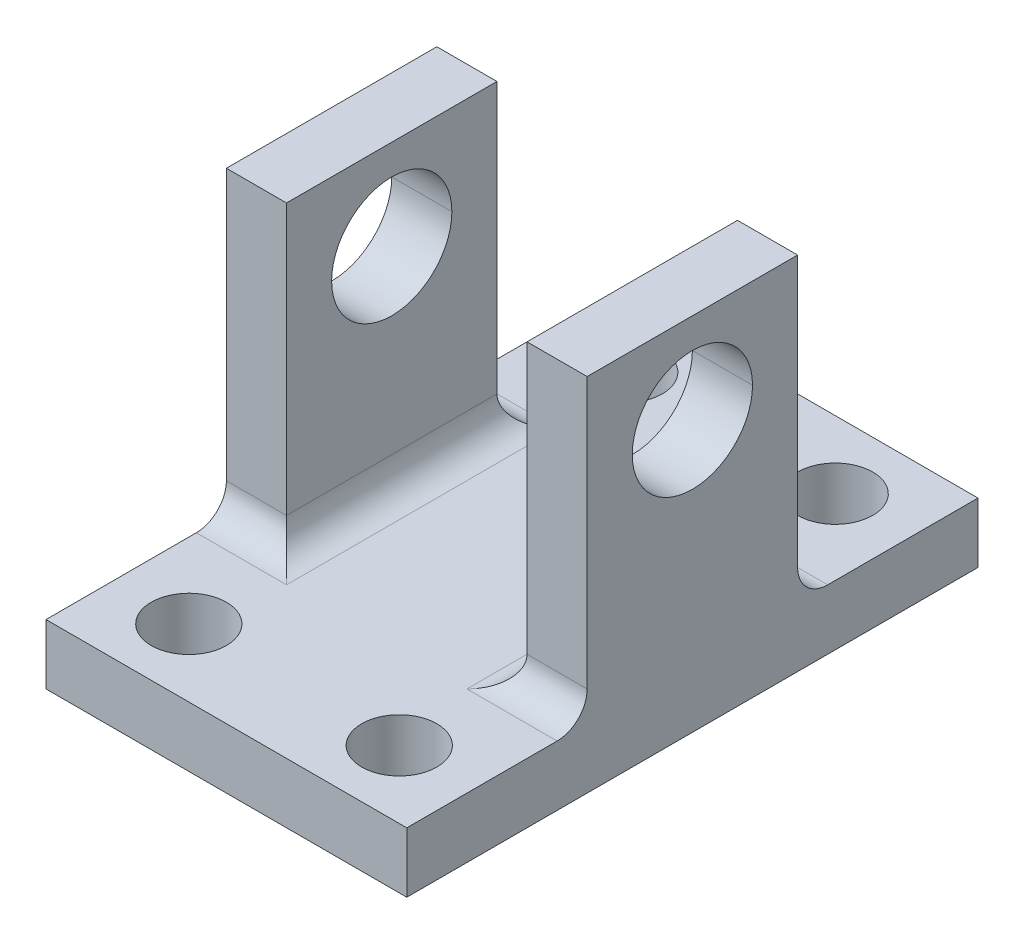
ISO-10303-21;
HEADER;
FILE_DESCRIPTION(('STEP AP214'),'2;1');
FILE_NAME('part.step','',(''),(''),'','','');
FILE_SCHEMA(('AUTOMOTIVE_DESIGN { 1 0 10303 214 1 1 1 1 }'));
ENDSEC;
DATA;
#1=APPLICATION_CONTEXT('core data for automotive mechanical design processes');
#2=APPLICATION_PROTOCOL_DEFINITION('international standard','automotive_design',2000,#1);
#3=PRODUCT_CONTEXT('',#1,'mechanical');
#4=PRODUCT('Part','Part','',(#3));
#5=PRODUCT_RELATED_PRODUCT_CATEGORY('part','',(#4));
#6=PRODUCT_DEFINITION_FORMATION('','',#4);
#7=PRODUCT_DEFINITION_CONTEXT('part definition',#1,'design');
#8=PRODUCT_DEFINITION('design','',#6,#7);
#9=PRODUCT_DEFINITION_SHAPE('','',#8);
#10=(LENGTH_UNIT() NAMED_UNIT(*) SI_UNIT(.MILLI.,.METRE.));
#11=(NAMED_UNIT(*) PLANE_ANGLE_UNIT() SI_UNIT($,.RADIAN.));
#12=(NAMED_UNIT(*) SI_UNIT($,.STERADIAN.) SOLID_ANGLE_UNIT());
#13=UNCERTAINTY_MEASURE_WITH_UNIT(LENGTH_MEASURE(1.E-05),#10,'distance_accuracy_value','');
#14=(GEOMETRIC_REPRESENTATION_CONTEXT(3) GLOBAL_UNCERTAINTY_ASSIGNED_CONTEXT((#13)) GLOBAL_UNIT_ASSIGNED_CONTEXT((#10,
#11,#12)) REPRESENTATION_CONTEXT('',''));
#15=CARTESIAN_POINT('',(0.,0.,0.));
#16=DIRECTION('',(0.,0.,1.));
#17=DIRECTION('',(1.,0.,0.));
#18=AXIS2_PLACEMENT_3D('',#15,#16,#17);
#19=CARTESIAN_POINT('',(0.,18.,0.));
#20=DIRECTION('',(-1.,0.,0.));
#21=DIRECTION('',(0.,-1.,0.));
#22=AXIS2_PLACEMENT_3D('',#19,#20,#21);
#23=CYLINDRICAL_SURFACE('',#22,4.);
#24=CARTESIAN_POINT('',(0.,18.,0.));
#25=DIRECTION('',(-1.,0.,0.));
#26=DIRECTION('',(0.,-1.,0.));
#27=AXIS2_PLACEMENT_3D('',#24,#25,#26);
#28=CIRCLE('',#27,4.);
#29=CARTESIAN_POINT('',(0.,18.,-4.));
#30=VERTEX_POINT('',#29);
#31=CARTESIAN_POINT('',(0.,18.,4.));
#32=VERTEX_POINT('',#31);
#33=EDGE_CURVE('E330',#30,#32,#28,.T.);
#34=ORIENTED_EDGE('',*,*,#33,.F.);
#35=DIRECTION('',(-1.,0.,0.));
#36=VECTOR('',#35,1.);
#37=CARTESIAN_POINT('',(0.,18.,-4.));
#38=LINE('',#37,#36);
#39=CARTESIAN_POINT('',(-4.,18.,-4.));
#40=VERTEX_POINT('',#39);
#41=EDGE_CURVE('E11',#30,#40,#38,.T.);
#42=ORIENTED_EDGE('',*,*,#41,.T.);
#43=CARTESIAN_POINT('',(-4.,18.,0.));
#44=DIRECTION('',(1.,0.,0.));
#45=DIRECTION('',(0.,1.,0.));
#46=AXIS2_PLACEMENT_3D('',#43,#44,#45);
#47=CIRCLE('',#46,4.);
#48=CARTESIAN_POINT('',(-4.,18.,4.));
#49=VERTEX_POINT('',#48);
#50=EDGE_CURVE('E333',#49,#40,#47,.T.);
#51=ORIENTED_EDGE('',*,*,#50,.F.);
#52=DIRECTION('',(1.,0.,0.));
#53=VECTOR('',#52,1.);
#54=CARTESIAN_POINT('',(0.,18.,4.));
#55=LINE('',#54,#53);
#56=EDGE_CURVE('E53',#49,#32,#55,.T.);
#57=ORIENTED_EDGE('',*,*,#56,.T.);
#58=EDGE_LOOP('',(#34,#42,#51,#57));
#59=FACE_BOUND('',#58,.T.);
#60=ADVANCED_FACE('F44',(#59),#23,.F.);
#61=CARTESIAN_POINT('',(-20.,18.,0.));
#62=DIRECTION('',(1.,0.,0.));
#63=DIRECTION('',(0.,1.,0.));
#64=AXIS2_PLACEMENT_3D('',#61,#62,#63);
#65=CIRCLE('',#64,4.);
#66=CARTESIAN_POINT('',(-20.,18.,4.));
#67=VERTEX_POINT('',#66);
#68=CARTESIAN_POINT('',(-20.,18.,-4.));
#69=VERTEX_POINT('',#68);
#70=EDGE_CURVE('E241',#67,#69,#65,.T.);
#71=ORIENTED_EDGE('',*,*,#70,.T.);
#72=DIRECTION('',(-1.,0.,0.));
#73=VECTOR('',#72,1.);
#74=CARTESIAN_POINT('',(0.,18.,-4.));
#75=LINE('',#74,#73);
#76=CARTESIAN_POINT('',(-24.,18.,-4.));
#77=VERTEX_POINT('',#76);
#78=EDGE_CURVE('E323',#69,#77,#75,.T.);
#79=ORIENTED_EDGE('',*,*,#78,.T.);
#80=CARTESIAN_POINT('',(-24.,18.,0.));
#81=DIRECTION('',(-1.,0.,0.));
#82=DIRECTION('',(0.,-1.,0.));
#83=AXIS2_PLACEMENT_3D('',#80,#81,#82);
#84=CIRCLE('',#83,4.);
#85=CARTESIAN_POINT('',(-24.,18.,4.));
#86=VERTEX_POINT('',#85);
#87=EDGE_CURVE('E415',#77,#86,#84,.T.);
#88=ORIENTED_EDGE('',*,*,#87,.T.);
#89=DIRECTION('',(1.,0.,0.));
#90=VECTOR('',#89,1.);
#91=CARTESIAN_POINT('',(0.,18.,4.));
#92=LINE('',#91,#90);
#93=EDGE_CURVE('E303',#86,#67,#92,.T.);
#94=ORIENTED_EDGE('',*,*,#93,.T.);
#95=EDGE_LOOP('',(#71,#79,#88,#94));
#96=FACE_BOUND('',#95,.T.);
#97=ADVANCED_FACE('F373',(#96),#23,.F.);
#98=CARTESIAN_POINT('',(-4.,24.,19.));
#99=DIRECTION('',(1.,0.,0.));
#100=DIRECTION('',(0.,1.,0.));
#101=AXIS2_PLACEMENT_3D('',#98,#99,#100);
#102=PLANE('',#101);
#103=ORIENTED_EDGE('',*,*,#50,.T.);
#104=EDGE_CURVE('E245',#40,#49,#47,.T.);
#105=ORIENTED_EDGE('',*,*,#104,.T.);
#106=EDGE_LOOP('',(#103,#105));
#107=FACE_BOUND('',#106,.T.);
#108=DIRECTION('',(0.,-1.,0.));
#109=VECTOR('',#108,1.);
#110=CARTESIAN_POINT('',(-4.,24.,-7.));
#111=LINE('',#110,#109);
#112=CARTESIAN_POINT('',(-4.,24.,-7.));
#113=VERTEX_POINT('',#112);
#114=CARTESIAN_POINT('',(-4.,6.,-7.));
#115=VERTEX_POINT('',#114);
#116=EDGE_CURVE('E376',#113,#115,#111,.T.);
#117=ORIENTED_EDGE('',*,*,#116,.T.);
#118=DIRECTION('',(0.,0.,-1.));
#119=VECTOR('',#118,1.);
#120=CARTESIAN_POINT('',(-4.,6.,7.));
#121=LINE('',#120,#119);
#122=CARTESIAN_POINT('',(-4.,6.,7.));
#123=VERTEX_POINT('',#122);
#124=EDGE_CURVE('E279',#115,#123,#121,.F.);
#125=ORIENTED_EDGE('',*,*,#124,.T.);
#126=DIRECTION('',(0.,1.,0.));
#127=VECTOR('',#126,1.);
#128=CARTESIAN_POINT('',(-4.,24.,7.));
#129=LINE('',#128,#127);
#130=CARTESIAN_POINT('',(-4.,24.,7.));
#131=VERTEX_POINT('',#130);
#132=EDGE_CURVE('E394',#123,#131,#129,.T.);
#133=ORIENTED_EDGE('',*,*,#132,.T.);
#134=DIRECTION('',(0.,0.,-1.));
#135=VECTOR('',#134,1.);
#136=CARTESIAN_POINT('',(-4.,24.,19.));
#137=LINE('',#136,#135);
#138=EDGE_CURVE('E228',#131,#113,#137,.T.);
#139=ORIENTED_EDGE('',*,*,#138,.T.);
#140=EDGE_LOOP('',(#117,#125,#133,#139));
#141=FACE_BOUND('',#140,.T.);
#142=ADVANCED_FACE('F369',(#107,#141),#102,.F.);
#143=CARTESIAN_POINT('',(-20.,24.,19.));
#144=DIRECTION('',(1.,0.,0.));
#145=DIRECTION('',(0.,1.,0.));
#146=AXIS2_PLACEMENT_3D('',#143,#144,#145);
#147=PLANE('',#146);
#148=DIRECTION('',(0.,1.,0.));
#149=VECTOR('',#148,1.);
#150=CARTESIAN_POINT('',(-20.,24.,7.));
#151=LINE('',#150,#149);
#152=CARTESIAN_POINT('',(-20.,6.,7.));
#153=VERTEX_POINT('',#152);
#154=CARTESIAN_POINT('',(-20.,24.,7.));
#155=VERTEX_POINT('',#154);
#156=EDGE_CURVE('E514',#153,#155,#151,.T.);
#157=ORIENTED_EDGE('',*,*,#156,.F.);
#158=DIRECTION('',(0.,0.,-1.));
#159=VECTOR('',#158,1.);
#160=CARTESIAN_POINT('',(-20.,6.,19.));
#161=LINE('',#160,#159);
#162=CARTESIAN_POINT('',(-20.,6.,-7.));
#163=VERTEX_POINT('',#162);
#164=EDGE_CURVE('E285',#153,#163,#161,.T.);
#165=ORIENTED_EDGE('',*,*,#164,.T.);
#166=DIRECTION('',(0.,-1.,0.));
#167=VECTOR('',#166,1.);
#168=CARTESIAN_POINT('',(-20.,24.,-7.));
#169=LINE('',#168,#167);
#170=CARTESIAN_POINT('',(-20.,24.,-7.));
#171=VERTEX_POINT('',#170);
#172=EDGE_CURVE('E385',#171,#163,#169,.T.);
#173=ORIENTED_EDGE('',*,*,#172,.F.);
#174=DIRECTION('',(0.,0.,-1.));
#175=VECTOR('',#174,1.);
#176=CARTESIAN_POINT('',(-20.,24.,19.));
#177=LINE('',#176,#175);
#178=EDGE_CURVE('E232',#155,#171,#177,.T.);
#179=ORIENTED_EDGE('',*,*,#178,.F.);
#180=EDGE_LOOP('',(#157,#165,#173,#179));
#181=FACE_BOUND('',#180,.T.);
#182=ORIENTED_EDGE('',*,*,#70,.F.);
#183=EDGE_CURVE('E246',#69,#67,#65,.T.);
#184=ORIENTED_EDGE('',*,*,#183,.F.);
#185=EDGE_LOOP('',(#182,#184));
#186=FACE_BOUND('',#185,.T.);
#187=ADVANCED_FACE('F372',(#181,#186),#147,.T.);
#188=CARTESIAN_POINT('',(-24.,0.,19.));
#189=DIRECTION('',(-1.,0.,0.));
#190=DIRECTION('',(0.,0.,1.));
#191=AXIS2_PLACEMENT_3D('',#188,#189,#190);
#192=PLANE('',#191);
#193=DIRECTION('',(0.,1.,0.));
#194=VECTOR('',#193,1.);
#195=CARTESIAN_POINT('',(-24.,24.,-7.));
#196=LINE('',#195,#194);
#197=CARTESIAN_POINT('',(-24.,6.,-7.));
#198=VERTEX_POINT('',#197);
#199=CARTESIAN_POINT('',(-24.,24.,-7.));
#200=VERTEX_POINT('',#199);
#201=EDGE_CURVE('E202',#198,#200,#196,.T.);
#202=ORIENTED_EDGE('',*,*,#201,.F.);
#203=CARTESIAN_POINT('',(-24.,6.,-9.));
#204=DIRECTION('',(-1.,0.,0.));
#205=DIRECTION('',(0.,0.,1.));
#206=AXIS2_PLACEMENT_3D('',#203,#204,#205);
#207=CIRCLE('',#206,2.);
#208=CARTESIAN_POINT('',(-24.,4.,-9.));
#209=VERTEX_POINT('',#208);
#210=EDGE_CURVE('E291',#198,#209,#207,.F.);
#211=ORIENTED_EDGE('',*,*,#210,.T.);
#212=DIRECTION('',(0.,0.,1.));
#213=VECTOR('',#212,1.);
#214=CARTESIAN_POINT('',(-24.,3.99999999999999,-19.));
#215=LINE('',#214,#213);
#216=CARTESIAN_POINT('',(-24.,3.99999999999999,-19.));
#217=VERTEX_POINT('',#216);
#218=EDGE_CURVE('E512',#217,#209,#215,.T.);
#219=ORIENTED_EDGE('',*,*,#218,.F.);
#220=DIRECTION('',(0.,1.,0.));
#221=VECTOR('',#220,1.);
#222=CARTESIAN_POINT('',(-24.,0.,-19.));
#223=LINE('',#222,#221);
#224=CARTESIAN_POINT('',(-24.,0.,-19.));
#225=VERTEX_POINT('',#224);
#226=EDGE_CURVE('E186',#225,#217,#223,.T.);
#227=ORIENTED_EDGE('',*,*,#226,.F.);
#228=DIRECTION('',(0.,0.,-1.));
#229=VECTOR('',#228,1.);
#230=CARTESIAN_POINT('',(-24.,0.,19.));
#231=LINE('',#230,#229);
#232=CARTESIAN_POINT('',(-24.,0.,19.));
#233=VERTEX_POINT('',#232);
#234=EDGE_CURVE('E218',#233,#225,#231,.T.);
#235=ORIENTED_EDGE('',*,*,#234,.F.);
#236=DIRECTION('',(0.,1.,0.));
#237=VECTOR('',#236,1.);
#238=CARTESIAN_POINT('',(-24.,0.,19.));
#239=LINE('',#238,#237);
#240=CARTESIAN_POINT('',(-24.,3.99999999999999,19.));
#241=VERTEX_POINT('',#240);
#242=EDGE_CURVE('E214',#233,#241,#239,.T.);
#243=ORIENTED_EDGE('',*,*,#242,.T.);
#244=DIRECTION('',(0.,0.,1.));
#245=VECTOR('',#244,1.);
#246=CARTESIAN_POINT('',(-24.,3.99999999999999,19.));
#247=LINE('',#246,#245);
#248=CARTESIAN_POINT('',(-24.,4.,9.));
#249=VERTEX_POINT('',#248);
#250=EDGE_CURVE('E498',#249,#241,#247,.T.);
#251=ORIENTED_EDGE('',*,*,#250,.F.);
#252=CARTESIAN_POINT('',(-24.,6.,9.));
#253=DIRECTION('',(-1.,0.,0.));
#254=DIRECTION('',(0.,0.,1.));
#255=AXIS2_PLACEMENT_3D('',#252,#253,#254);
#256=CIRCLE('',#255,2.);
#257=CARTESIAN_POINT('',(-24.,6.,7.));
#258=VERTEX_POINT('',#257);
#259=EDGE_CURVE('E300',#249,#258,#256,.F.);
#260=ORIENTED_EDGE('',*,*,#259,.T.);
#261=DIRECTION('',(0.,-1.,0.));
#262=VECTOR('',#261,1.);
#263=CARTESIAN_POINT('',(-24.,24.,7.));
#264=LINE('',#263,#262);
#265=CARTESIAN_POINT('',(-24.,24.,7.));
#266=VERTEX_POINT('',#265);
#267=EDGE_CURVE('E313',#266,#258,#264,.T.);
#268=ORIENTED_EDGE('',*,*,#267,.F.);
#269=DIRECTION('',(0.,0.,-1.));
#270=VECTOR('',#269,1.);
#271=CARTESIAN_POINT('',(-24.,24.,19.));
#272=LINE('',#271,#270);
#273=EDGE_CURVE('E236',#266,#200,#272,.T.);
#274=ORIENTED_EDGE('',*,*,#273,.T.);
#275=EDGE_LOOP('',(#202,#211,#219,#227,#235,#243,#251,#260,#268,#274));
#276=FACE_BOUND('',#275,.T.);
#277=EDGE_CURVE('E342',#86,#77,#84,.T.);
#278=ORIENTED_EDGE('',*,*,#277,.F.);
#279=ORIENTED_EDGE('',*,*,#87,.F.);
#280=EDGE_LOOP('',(#278,#279));
#281=FACE_BOUND('',#280,.T.);
#282=ADVANCED_FACE('F432',(#276,#281),#192,.T.);
#283=CARTESIAN_POINT('',(-24.,0.,19.));
#284=DIRECTION('',(0.,1.,0.));
#285=DIRECTION('',(0.,0.,1.));
#286=AXIS2_PLACEMENT_3D('',#283,#284,#285);
#287=PLANE('',#286);
#288=CARTESIAN_POINT('',(-19.,0.,14.5));
#289=DIRECTION('',(0.,1.,0.));
#290=DIRECTION('',(1.,0.,0.));
#291=AXIS2_PLACEMENT_3D('',#288,#289,#290);
#292=CIRCLE('',#291,2.5);
#293=CARTESIAN_POINT('',(-16.5,0.,14.5));
#294=VERTEX_POINT('',#293);
#295=EDGE_CURVE('E384',#294,#294,#292,.T.);
#296=ORIENTED_EDGE('',*,*,#295,.T.);
#297=EDGE_LOOP('',(#296));
#298=FACE_BOUND('',#297,.T.);
#299=CARTESIAN_POINT('',(-4.99999999999999,0.,14.5));
#300=DIRECTION('',(0.,1.,0.));
#301=DIRECTION('',(-1.,0.,0.));
#302=AXIS2_PLACEMENT_3D('',#299,#300,#301);
#303=CIRCLE('',#302,2.5);
#304=CARTESIAN_POINT('',(-7.49999999999999,0.,14.5));
#305=VERTEX_POINT('',#304);
#306=EDGE_CURVE('E391',#305,#305,#303,.T.);
#307=ORIENTED_EDGE('',*,*,#306,.T.);
#308=EDGE_LOOP('',(#307));
#309=FACE_BOUND('',#308,.T.);
#310=CARTESIAN_POINT('',(-4.99999999999999,0.,-14.5));
#311=DIRECTION('',(0.,1.,0.));
#312=DIRECTION('',(1.,0.,0.));
#313=AXIS2_PLACEMENT_3D('',#310,#311,#312);
#314=CIRCLE('',#313,2.5);
#315=CARTESIAN_POINT('',(-2.49999999999999,0.,-14.5));
#316=VERTEX_POINT('',#315);
#317=EDGE_CURVE('E398',#316,#316,#314,.T.);
#318=ORIENTED_EDGE('',*,*,#317,.T.);
#319=EDGE_LOOP('',(#318));
#320=FACE_BOUND('',#319,.T.);
#321=CARTESIAN_POINT('',(-19.,0.,-14.5));
#322=DIRECTION('',(0.,1.,0.));
#323=DIRECTION('',(-1.,0.,0.));
#324=AXIS2_PLACEMENT_3D('',#321,#322,#323);
#325=CIRCLE('',#324,2.5);
#326=CARTESIAN_POINT('',(-21.5,0.,-14.5));
#327=VERTEX_POINT('',#326);
#328=EDGE_CURVE('E402',#327,#327,#325,.T.);
#329=ORIENTED_EDGE('',*,*,#328,.T.);
#330=EDGE_LOOP('',(#329));
#331=FACE_BOUND('',#330,.T.);
#332=DIRECTION('',(1.,0.,0.));
#333=VECTOR('',#332,1.);
#334=CARTESIAN_POINT('',(-24.,0.,-19.));
#335=LINE('',#334,#333);
#336=CARTESIAN_POINT('',(0.,0.,-19.));
#337=VERTEX_POINT('',#336);
#338=EDGE_CURVE('E210',#225,#337,#335,.T.);
#339=ORIENTED_EDGE('',*,*,#338,.T.);
#340=DIRECTION('',(0.,0.,-1.));
#341=VECTOR('',#340,1.);
#342=CARTESIAN_POINT('',(0.,0.,19.));
#343=LINE('',#342,#341);
#344=CARTESIAN_POINT('',(0.,0.,19.));
#345=VERTEX_POINT('',#344);
#346=EDGE_CURVE('E208',#345,#337,#343,.T.);
#347=ORIENTED_EDGE('',*,*,#346,.F.);
#348=DIRECTION('',(1.,0.,0.));
#349=VECTOR('',#348,1.);
#350=CARTESIAN_POINT('',(-24.,0.,19.));
#351=LINE('',#350,#349);
#352=EDGE_CURVE('E240',#233,#345,#351,.T.);
#353=ORIENTED_EDGE('',*,*,#352,.F.);
#354=ORIENTED_EDGE('',*,*,#234,.T.);
#355=EDGE_LOOP('',(#339,#347,#353,#354));
#356=FACE_BOUND('',#355,.T.);
#357=ADVANCED_FACE('F434',(#298,#309,#320,#331,#356),#287,.F.);
#358=CARTESIAN_POINT('',(0.,0.,19.));
#359=DIRECTION('',(-1.,0.,0.));
#360=DIRECTION('',(0.,0.,1.));
#361=AXIS2_PLACEMENT_3D('',#358,#359,#360);
#362=PLANE('',#361);
#363=EDGE_CURVE('E334',#32,#30,#28,.T.);
#364=ORIENTED_EDGE('',*,*,#363,.T.);
#365=ORIENTED_EDGE('',*,*,#33,.T.);
#366=EDGE_LOOP('',(#364,#365));
#367=FACE_BOUND('',#366,.T.);
#368=DIRECTION('',(0.,0.,1.));
#369=VECTOR('',#368,1.);
#370=CARTESIAN_POINT('',(0.,3.99999999999999,-19.));
#371=LINE('',#370,#369);
#372=CARTESIAN_POINT('',(0.,3.99999999999999,-19.));
#373=VERTEX_POINT('',#372);
#374=CARTESIAN_POINT('',(0.,4.,-9.));
#375=VERTEX_POINT('',#374);
#376=EDGE_CURVE('E193',#373,#375,#371,.T.);
#377=ORIENTED_EDGE('',*,*,#376,.T.);
#378=CARTESIAN_POINT('',(0.,6.,-9.));
#379=DIRECTION('',(-1.,0.,0.));
#380=DIRECTION('',(0.,0.,1.));
#381=AXIS2_PLACEMENT_3D('',#378,#379,#380);
#382=CIRCLE('',#381,2.);
#383=CARTESIAN_POINT('',(0.,6.,-7.));
#384=VERTEX_POINT('',#383);
#385=EDGE_CURVE('E294',#375,#384,#382,.T.);
#386=ORIENTED_EDGE('',*,*,#385,.T.);
#387=DIRECTION('',(0.,1.,0.));
#388=VECTOR('',#387,1.);
#389=CARTESIAN_POINT('',(0.,24.,-7.));
#390=LINE('',#389,#388);
#391=CARTESIAN_POINT('',(0.,24.,-7.));
#392=VERTEX_POINT('',#391);
#393=EDGE_CURVE('E201',#384,#392,#390,.T.);
#394=ORIENTED_EDGE('',*,*,#393,.T.);
#395=DIRECTION('',(0.,0.,-1.));
#396=VECTOR('',#395,1.);
#397=CARTESIAN_POINT('',(0.,24.,19.));
#398=LINE('',#397,#396);
#399=CARTESIAN_POINT('',(0.,24.,7.));
#400=VERTEX_POINT('',#399);
#401=EDGE_CURVE('E224',#400,#392,#398,.T.);
#402=ORIENTED_EDGE('',*,*,#401,.F.);
#403=DIRECTION('',(0.,-1.,0.));
#404=VECTOR('',#403,1.);
#405=CARTESIAN_POINT('',(0.,24.,7.));
#406=LINE('',#405,#404);
#407=CARTESIAN_POINT('',(0.,6.,7.));
#408=VERTEX_POINT('',#407);
#409=EDGE_CURVE('E502',#400,#408,#406,.T.);
#410=ORIENTED_EDGE('',*,*,#409,.T.);
#411=CARTESIAN_POINT('',(0.,6.,9.));
#412=DIRECTION('',(-1.,0.,0.));
#413=DIRECTION('',(0.,0.,1.));
#414=AXIS2_PLACEMENT_3D('',#411,#412,#413);
#415=CIRCLE('',#414,2.);
#416=CARTESIAN_POINT('',(0.,4.,9.));
#417=VERTEX_POINT('',#416);
#418=EDGE_CURVE('E297',#408,#417,#415,.T.);
#419=ORIENTED_EDGE('',*,*,#418,.T.);
#420=DIRECTION('',(0.,0.,1.));
#421=VECTOR('',#420,1.);
#422=CARTESIAN_POINT('',(0.,3.99999999999999,19.));
#423=LINE('',#422,#421);
#424=CARTESIAN_POINT('',(0.,3.99999999999999,19.));
#425=VERTEX_POINT('',#424);
#426=EDGE_CURVE('E505',#417,#425,#423,.T.);
#427=ORIENTED_EDGE('',*,*,#426,.T.);
#428=DIRECTION('',(0.,1.,0.));
#429=VECTOR('',#428,1.);
#430=CARTESIAN_POINT('',(0.,0.,19.));
#431=LINE('',#430,#429);
#432=EDGE_CURVE('E355',#345,#425,#431,.T.);
#433=ORIENTED_EDGE('',*,*,#432,.F.);
#434=ORIENTED_EDGE('',*,*,#346,.T.);
#435=DIRECTION('',(0.,1.,0.));
#436=VECTOR('',#435,1.);
#437=CARTESIAN_POINT('',(0.,0.,-19.));
#438=LINE('',#437,#436);
#439=EDGE_CURVE('E184',#337,#373,#438,.T.);
#440=ORIENTED_EDGE('',*,*,#439,.T.);
#441=EDGE_LOOP('',(#377,#386,#394,#402,#410,#419,#427,#433,#434,#440));
#442=FACE_BOUND('',#441,.T.);
#443=ADVANCED_FACE('F205',(#367,#442),#362,.F.);
#444=CARTESIAN_POINT('',(0.,24.,19.));
#445=DIRECTION('',(0.,-1.,0.));
#446=DIRECTION('',(1.,0.,0.));
#447=AXIS2_PLACEMENT_3D('',#444,#445,#446);
#448=PLANE('',#447);
#449=ORIENTED_EDGE('',*,*,#401,.T.);
#450=DIRECTION('',(-1.,0.,0.));
#451=VECTOR('',#450,1.);
#452=CARTESIAN_POINT('',(0.,24.,-7.));
#453=LINE('',#452,#451);
#454=EDGE_CURVE('E489',#392,#113,#453,.T.);
#455=ORIENTED_EDGE('',*,*,#454,.T.);
#456=ORIENTED_EDGE('',*,*,#138,.F.);
#457=DIRECTION('',(-1.,0.,0.));
#458=VECTOR('',#457,1.);
#459=CARTESIAN_POINT('',(0.,24.,7.));
#460=LINE('',#459,#458);
#461=EDGE_CURVE('E508',#400,#131,#460,.T.);
#462=ORIENTED_EDGE('',*,*,#461,.F.);
#463=EDGE_LOOP('',(#449,#455,#456,#462));
#464=FACE_BOUND('',#463,.T.);
#465=ADVANCED_FACE('F471',(#464),#448,.F.);
#466=CARTESIAN_POINT('',(-4.,4.,19.));
#467=DIRECTION('',(0.,-1.,0.));
#468=DIRECTION('',(1.,0.,0.));
#469=AXIS2_PLACEMENT_3D('',#466,#467,#468);
#470=PLANE('',#469);
#471=CARTESIAN_POINT('',(-4.99999999999999,4.,-14.5));
#472=DIRECTION('',(0.,-1.,0.));
#473=DIRECTION('',(1.,0.,0.));
#474=AXIS2_PLACEMENT_3D('',#471,#472,#473);
#475=CIRCLE('',#474,2.5);
#476=CARTESIAN_POINT('',(-2.49999999999999,4.,-14.5));
#477=VERTEX_POINT('',#476);
#478=EDGE_CURVE('E221',#477,#477,#475,.T.);
#479=ORIENTED_EDGE('',*,*,#478,.T.);
#480=EDGE_LOOP('',(#479));
#481=FACE_BOUND('',#480,.T.);
#482=DIRECTION('',(0.,0.,-1.));
#483=VECTOR('',#482,1.);
#484=CARTESIAN_POINT('',(-6.,4.,-7.));
#485=LINE('',#484,#483);
#486=CARTESIAN_POINT('',(-6.,4.,9.));
#487=VERTEX_POINT('',#486);
#488=CARTESIAN_POINT('',(-6.,4.,-9.));
#489=VERTEX_POINT('',#488);
#490=EDGE_CURVE('E270',#487,#489,#485,.T.);
#491=ORIENTED_EDGE('',*,*,#490,.T.);
#492=DIRECTION('',(-1.,0.,0.));
#493=VECTOR('',#492,1.);
#494=CARTESIAN_POINT('',(0.,4.,-9.));
#495=LINE('',#494,#493);
#496=EDGE_CURVE('E197',#489,#375,#495,.F.);
#497=ORIENTED_EDGE('',*,*,#496,.T.);
#498=ORIENTED_EDGE('',*,*,#376,.F.);
#499=DIRECTION('',(-1.,0.,0.));
#500=VECTOR('',#499,1.);
#501=CARTESIAN_POINT('',(-4.,4.,-19.));
#502=LINE('',#501,#500);
#503=EDGE_CURVE('E179',#373,#217,#502,.T.);
#504=ORIENTED_EDGE('',*,*,#503,.T.);
#505=ORIENTED_EDGE('',*,*,#218,.T.);
#506=DIRECTION('',(-1.,0.,0.));
#507=VECTOR('',#506,1.);
#508=CARTESIAN_POINT('',(-20.,4.,-9.));
#509=LINE('',#508,#507);
#510=CARTESIAN_POINT('',(-18.,4.,-9.));
#511=VERTEX_POINT('',#510);
#512=EDGE_CURVE('E264',#209,#511,#509,.F.);
#513=ORIENTED_EDGE('',*,*,#512,.T.);
#514=DIRECTION('',(0.,0.,-1.));
#515=VECTOR('',#514,1.);
#516=CARTESIAN_POINT('',(-18.,4.,19.));
#517=LINE('',#516,#515);
#518=CARTESIAN_POINT('',(-18.,4.,9.));
#519=VERTEX_POINT('',#518);
#520=EDGE_CURVE('E261',#511,#519,#517,.F.);
#521=ORIENTED_EDGE('',*,*,#520,.T.);
#522=DIRECTION('',(-1.,0.,0.));
#523=VECTOR('',#522,1.);
#524=CARTESIAN_POINT('',(-24.,4.,9.));
#525=LINE('',#524,#523);
#526=EDGE_CURVE('E258',#519,#249,#525,.T.);
#527=ORIENTED_EDGE('',*,*,#526,.T.);
#528=ORIENTED_EDGE('',*,*,#250,.T.);
#529=DIRECTION('',(-1.,0.,0.));
#530=VECTOR('',#529,1.);
#531=CARTESIAN_POINT('',(-4.,4.,19.));
#532=LINE('',#531,#530);
#533=EDGE_CURVE('E351',#425,#241,#532,.T.);
#534=ORIENTED_EDGE('',*,*,#533,.F.);
#535=ORIENTED_EDGE('',*,*,#426,.F.);
#536=DIRECTION('',(-1.,0.,0.));
#537=VECTOR('',#536,1.);
#538=CARTESIAN_POINT('',(-4.,4.,9.));
#539=LINE('',#538,#537);
#540=EDGE_CURVE('E267',#417,#487,#539,.T.);
#541=ORIENTED_EDGE('',*,*,#540,.T.);
#542=EDGE_LOOP('',(#491,#497,#498,#504,#505,#513,#521,#527,#528,#534,#535,#541));
#543=FACE_BOUND('',#542,.T.);
#544=CARTESIAN_POINT('',(-19.,4.,-14.5));
#545=DIRECTION('',(0.,-1.,0.));
#546=DIRECTION('',(1.,0.,0.));
#547=AXIS2_PLACEMENT_3D('',#544,#545,#546);
#548=CIRCLE('',#547,2.5);
#549=CARTESIAN_POINT('',(-16.5,4.,-14.5));
#550=VERTEX_POINT('',#549);
#551=EDGE_CURVE('E409',#550,#550,#548,.T.);
#552=ORIENTED_EDGE('',*,*,#551,.T.);
#553=EDGE_LOOP('',(#552));
#554=FACE_BOUND('',#553,.T.);
#555=CARTESIAN_POINT('',(-4.99999999999999,4.,14.5));
#556=DIRECTION('',(0.,-1.,0.));
#557=DIRECTION('',(1.,0.,0.));
#558=AXIS2_PLACEMENT_3D('',#555,#556,#557);
#559=CIRCLE('',#558,2.5);
#560=CARTESIAN_POINT('',(-2.49999999999999,4.,14.5));
#561=VERTEX_POINT('',#560);
#562=EDGE_CURVE('E250',#561,#561,#559,.T.);
#563=ORIENTED_EDGE('',*,*,#562,.T.);
#564=EDGE_LOOP('',(#563));
#565=FACE_BOUND('',#564,.T.);
#566=CARTESIAN_POINT('',(-19.,4.,14.5));
#567=DIRECTION('',(0.,-1.,0.));
#568=DIRECTION('',(1.,0.,0.));
#569=AXIS2_PLACEMENT_3D('',#566,#567,#568);
#570=CIRCLE('',#569,2.5);
#571=CARTESIAN_POINT('',(-16.5,4.,14.5));
#572=VERTEX_POINT('',#571);
#573=EDGE_CURVE('E412',#572,#572,#570,.T.);
#574=ORIENTED_EDGE('',*,*,#573,.T.);
#575=EDGE_LOOP('',(#574));
#576=FACE_BOUND('',#575,.T.);
#577=ADVANCED_FACE('F194',(#481,#543,#554,#565,#576),#470,.F.);
#578=CARTESIAN_POINT('',(-24.,24.,19.));
#579=DIRECTION('',(0.,1.,0.));
#580=DIRECTION('',(0.,0.,1.));
#581=AXIS2_PLACEMENT_3D('',#578,#579,#580);
#582=PLANE('',#581);
#583=EDGE_CURVE('E483',#171,#200,#453,.T.);
#584=ORIENTED_EDGE('',*,*,#583,.T.);
#585=ORIENTED_EDGE('',*,*,#273,.F.);
#586=EDGE_CURVE('E513',#155,#266,#460,.T.);
#587=ORIENTED_EDGE('',*,*,#586,.F.);
#588=ORIENTED_EDGE('',*,*,#178,.T.);
#589=EDGE_LOOP('',(#584,#585,#587,#588));
#590=FACE_BOUND('',#589,.T.);
#591=ADVANCED_FACE('F466',(#590),#582,.T.);
#592=CARTESIAN_POINT('',(0.,0.,19.));
#593=DIRECTION('',(0.,0.,-1.));
#594=DIRECTION('',(-1.,0.,0.));
#595=AXIS2_PLACEMENT_3D('',#592,#593,#594);
#596=PLANE('',#595);
#597=ORIENTED_EDGE('',*,*,#432,.T.);
#598=ORIENTED_EDGE('',*,*,#533,.T.);
#599=ORIENTED_EDGE('',*,*,#242,.F.);
#600=ORIENTED_EDGE('',*,*,#352,.T.);
#601=EDGE_LOOP('',(#597,#598,#599,#600));
#602=FACE_BOUND('',#601,.T.);
#603=ADVANCED_FACE('F461',(#602),#596,.F.);
#604=CARTESIAN_POINT('',(0.,0.,-19.));
#605=DIRECTION('',(0.,0.,-1.));
#606=DIRECTION('',(-1.,0.,0.));
#607=AXIS2_PLACEMENT_3D('',#604,#605,#606);
#608=PLANE('',#607);
#609=ORIENTED_EDGE('',*,*,#503,.F.);
#610=ORIENTED_EDGE('',*,*,#439,.F.);
#611=ORIENTED_EDGE('',*,*,#338,.F.);
#612=ORIENTED_EDGE('',*,*,#226,.T.);
#613=EDGE_LOOP('',(#609,#610,#611,#612));
#614=FACE_BOUND('',#613,.T.);
#615=ADVANCED_FACE('F181',(#614),#608,.T.);
#616=ORIENTED_EDGE('',*,*,#78,.F.);
#617=ORIENTED_EDGE('',*,*,#183,.T.);
#618=ORIENTED_EDGE('',*,*,#93,.F.);
#619=ORIENTED_EDGE('',*,*,#277,.T.);
#620=EDGE_LOOP('',(#616,#617,#618,#619));
#621=FACE_BOUND('',#620,.T.);
#622=ADVANCED_FACE('F429',(#621),#23,.F.);
#623=ORIENTED_EDGE('',*,*,#41,.F.);
#624=ORIENTED_EDGE('',*,*,#363,.F.);
#625=ORIENTED_EDGE('',*,*,#56,.F.);
#626=ORIENTED_EDGE('',*,*,#104,.F.);
#627=EDGE_LOOP('',(#623,#624,#625,#626));
#628=FACE_BOUND('',#627,.T.);
#629=ADVANCED_FACE('F335',(#628),#23,.F.);
#630=CARTESIAN_POINT('',(-19.,0.,-14.5));
#631=DIRECTION('',(0.,1.,0.));
#632=DIRECTION('',(-1.,0.,0.));
#633=AXIS2_PLACEMENT_3D('',#630,#631,#632);
#634=CYLINDRICAL_SURFACE('',#633,2.5);
#635=ORIENTED_EDGE('',*,*,#551,.F.);
#636=EDGE_LOOP('',(#635));
#637=FACE_BOUND('',#636,.T.);
#638=ORIENTED_EDGE('',*,*,#328,.F.);
#639=EDGE_LOOP('',(#638));
#640=FACE_BOUND('',#639,.T.);
#641=ADVANCED_FACE('F460',(#637,#640),#634,.F.);
#642=CARTESIAN_POINT('',(-19.,0.,14.5));
#643=DIRECTION('',(0.,1.,0.));
#644=DIRECTION('',(-1.,0.,0.));
#645=AXIS2_PLACEMENT_3D('',#642,#643,#644);
#646=CYLINDRICAL_SURFACE('',#645,2.5);
#647=ORIENTED_EDGE('',*,*,#573,.F.);
#648=EDGE_LOOP('',(#647));
#649=FACE_BOUND('',#648,.T.);
#650=ORIENTED_EDGE('',*,*,#295,.F.);
#651=EDGE_LOOP('',(#650));
#652=FACE_BOUND('',#651,.T.);
#653=ADVANCED_FACE('F651',(#649,#652),#646,.F.);
#654=CARTESIAN_POINT('',(-4.99999999999999,0.,-14.5));
#655=DIRECTION('',(0.,1.,0.));
#656=DIRECTION('',(-1.,0.,0.));
#657=AXIS2_PLACEMENT_3D('',#654,#655,#656);
#658=CYLINDRICAL_SURFACE('',#657,2.5);
#659=ORIENTED_EDGE('',*,*,#317,.F.);
#660=EDGE_LOOP('',(#659));
#661=FACE_BOUND('',#660,.T.);
#662=ORIENTED_EDGE('',*,*,#478,.F.);
#663=EDGE_LOOP('',(#662));
#664=FACE_BOUND('',#663,.T.);
#665=ADVANCED_FACE('F641',(#661,#664),#658,.F.);
#666=CARTESIAN_POINT('',(-4.99999999999999,0.,14.5));
#667=DIRECTION('',(0.,1.,0.));
#668=DIRECTION('',(-1.,0.,0.));
#669=AXIS2_PLACEMENT_3D('',#666,#667,#668);
#670=CYLINDRICAL_SURFACE('',#669,2.5);
#671=ORIENTED_EDGE('',*,*,#306,.F.);
#672=EDGE_LOOP('',(#671));
#673=FACE_BOUND('',#672,.T.);
#674=ORIENTED_EDGE('',*,*,#562,.F.);
#675=EDGE_LOOP('',(#674));
#676=FACE_BOUND('',#675,.T.);
#677=ADVANCED_FACE('F632',(#673,#676),#670,.F.);
#678=CARTESIAN_POINT('',(0.,24.,7.));
#679=DIRECTION('',(0.,0.,-1.));
#680=DIRECTION('',(0.,1.,0.));
#681=AXIS2_PLACEMENT_3D('',#678,#679,#680);
#682=PLANE('',#681);
#683=ORIENTED_EDGE('',*,*,#132,.F.);
#684=DIRECTION('',(-1.,0.,0.));
#685=VECTOR('',#684,1.);
#686=CARTESIAN_POINT('',(0.,6.,7.));
#687=LINE('',#686,#685);
#688=EDGE_CURVE('E282',#123,#408,#687,.F.);
#689=ORIENTED_EDGE('',*,*,#688,.T.);
#690=ORIENTED_EDGE('',*,*,#409,.F.);
#691=ORIENTED_EDGE('',*,*,#461,.T.);
#692=EDGE_LOOP('',(#683,#689,#690,#691));
#693=FACE_BOUND('',#692,.T.);
#694=ADVANCED_FACE('F521',(#693),#682,.F.);
#695=CARTESIAN_POINT('',(0.,24.,-7.));
#696=DIRECTION('',(0.,0.,1.));
#697=DIRECTION('',(0.,-1.,0.));
#698=AXIS2_PLACEMENT_3D('',#695,#696,#697);
#699=PLANE('',#698);
#700=ORIENTED_EDGE('',*,*,#393,.F.);
#701=DIRECTION('',(-1.,0.,0.));
#702=VECTOR('',#701,1.);
#703=CARTESIAN_POINT('',(-4.,6.,-7.));
#704=LINE('',#703,#702);
#705=EDGE_CURVE('E275',#384,#115,#704,.T.);
#706=ORIENTED_EDGE('',*,*,#705,.T.);
#707=ORIENTED_EDGE('',*,*,#116,.F.);
#708=ORIENTED_EDGE('',*,*,#454,.F.);
#709=EDGE_LOOP('',(#700,#706,#707,#708));
#710=FACE_BOUND('',#709,.T.);
#711=ADVANCED_FACE('F559',(#710),#699,.F.);
#712=ORIENTED_EDGE('',*,*,#267,.T.);
#713=DIRECTION('',(-1.,0.,0.));
#714=VECTOR('',#713,1.);
#715=CARTESIAN_POINT('',(-20.,6.,7.));
#716=LINE('',#715,#714);
#717=EDGE_CURVE('E288',#258,#153,#716,.F.);
#718=ORIENTED_EDGE('',*,*,#717,.T.);
#719=ORIENTED_EDGE('',*,*,#156,.T.);
#720=ORIENTED_EDGE('',*,*,#586,.T.);
#721=EDGE_LOOP('',(#712,#718,#719,#720));
#722=FACE_BOUND('',#721,.T.);
#723=ADVANCED_FACE('F538',(#722),#682,.F.);
#724=ORIENTED_EDGE('',*,*,#172,.T.);
#725=DIRECTION('',(-1.,0.,0.));
#726=VECTOR('',#725,1.);
#727=CARTESIAN_POINT('',(-24.,6.,-7.));
#728=LINE('',#727,#726);
#729=EDGE_CURVE('E254',#163,#198,#728,.T.);
#730=ORIENTED_EDGE('',*,*,#729,.T.);
#731=ORIENTED_EDGE('',*,*,#201,.T.);
#732=ORIENTED_EDGE('',*,*,#583,.F.);
#733=EDGE_LOOP('',(#724,#730,#731,#732));
#734=FACE_BOUND('',#733,.T.);
#735=ADVANCED_FACE('F544',(#734),#699,.F.);
#736=CARTESIAN_POINT('',(-4.,6.,9.));
#737=DIRECTION('',(1.,0.,0.));
#738=DIRECTION('',(0.,1.,0.));
#739=AXIS2_PLACEMENT_3D('',#736,#737,#738);
#740=CYLINDRICAL_SURFACE('',#739,2.);
#741=ORIENTED_EDGE('',*,*,#259,.F.);
#742=ORIENTED_EDGE('',*,*,#526,.F.);
#743=CARTESIAN_POINT('',(-18.,6.,9.));
#744=DIRECTION('',(0.707106781186547,0.,-0.707106781186547));
#745=DIRECTION('',(0.707106781186547,0.,0.707106781186547));
#746=AXIS2_PLACEMENT_3D('',#743,#744,#745);
#747=ELLIPSE('',#746,2.82842712474619,2.);
#748=EDGE_CURVE('E308',#153,#519,#747,.F.);
#749=ORIENTED_EDGE('',*,*,#748,.F.);
#750=ORIENTED_EDGE('',*,*,#717,.F.);
#751=EDGE_LOOP('',(#741,#742,#749,#750));
#752=FACE_BOUND('',#751,.T.);
#753=ADVANCED_FACE('F574',(#752),#740,.F.);
#754=CARTESIAN_POINT('',(-18.,6.,19.));
#755=DIRECTION('',(0.,0.,-1.));
#756=DIRECTION('',(-1.,0.,0.));
#757=AXIS2_PLACEMENT_3D('',#754,#755,#756);
#758=CYLINDRICAL_SURFACE('',#757,2.);
#759=ORIENTED_EDGE('',*,*,#748,.T.);
#760=ORIENTED_EDGE('',*,*,#520,.F.);
#761=CARTESIAN_POINT('',(-18.,6.,-9.));
#762=DIRECTION('',(-0.707106781186547,0.,-0.707106781186547));
#763=DIRECTION('',(0.707106781186547,0.,-0.707106781186547));
#764=AXIS2_PLACEMENT_3D('',#761,#762,#763);
#765=ELLIPSE('',#764,2.82842712474619,2.);
#766=EDGE_CURVE('E304',#163,#511,#765,.F.);
#767=ORIENTED_EDGE('',*,*,#766,.F.);
#768=ORIENTED_EDGE('',*,*,#164,.F.);
#769=EDGE_LOOP('',(#759,#760,#767,#768));
#770=FACE_BOUND('',#769,.T.);
#771=ADVANCED_FACE('F548',(#770),#758,.F.);
#772=CARTESIAN_POINT('',(0.,6.,-9.));
#773=DIRECTION('',(1.,0.,0.));
#774=DIRECTION('',(0.,1.,0.));
#775=AXIS2_PLACEMENT_3D('',#772,#773,#774);
#776=CYLINDRICAL_SURFACE('',#775,2.);
#777=ORIENTED_EDGE('',*,*,#766,.T.);
#778=ORIENTED_EDGE('',*,*,#512,.F.);
#779=ORIENTED_EDGE('',*,*,#210,.F.);
#780=ORIENTED_EDGE('',*,*,#729,.F.);
#781=EDGE_LOOP('',(#777,#778,#779,#780));
#782=FACE_BOUND('',#781,.T.);
#783=ADVANCED_FACE('F551',(#782),#776,.F.);
#784=CARTESIAN_POINT('',(-4.,6.,9.));
#785=DIRECTION('',(1.,0.,0.));
#786=DIRECTION('',(0.,1.,0.));
#787=AXIS2_PLACEMENT_3D('',#784,#785,#786);
#788=CYLINDRICAL_SURFACE('',#787,2.);
#789=ORIENTED_EDGE('',*,*,#418,.F.);
#790=ORIENTED_EDGE('',*,*,#688,.F.);
#791=CARTESIAN_POINT('',(-6.,6.,9.));
#792=DIRECTION('',(0.707106781186547,0.,0.707106781186547));
#793=DIRECTION('',(0.707106781186547,0.,-0.707106781186547));
#794=AXIS2_PLACEMENT_3D('',#791,#792,#793);
#795=ELLIPSE('',#794,2.82842712474619,2.);
#796=EDGE_CURVE('E309',#487,#123,#795,.T.);
#797=ORIENTED_EDGE('',*,*,#796,.F.);
#798=ORIENTED_EDGE('',*,*,#540,.F.);
#799=EDGE_LOOP('',(#789,#790,#797,#798));
#800=FACE_BOUND('',#799,.T.);
#801=ADVANCED_FACE('F46',(#800),#788,.F.);
#802=CARTESIAN_POINT('',(-6.,6.,19.));
#803=DIRECTION('',(0.,0.,1.));
#804=DIRECTION('',(1.,0.,0.));
#805=AXIS2_PLACEMENT_3D('',#802,#803,#804);
#806=CYLINDRICAL_SURFACE('',#805,2.);
#807=ORIENTED_EDGE('',*,*,#796,.T.);
#808=ORIENTED_EDGE('',*,*,#124,.F.);
#809=CARTESIAN_POINT('',(-6.,6.,-9.));
#810=DIRECTION('',(-0.707106781186547,0.,0.707106781186547));
#811=DIRECTION('',(0.707106781186547,0.,0.707106781186547));
#812=AXIS2_PLACEMENT_3D('',#809,#810,#811);
#813=ELLIPSE('',#812,2.82842712474619,2.);
#814=EDGE_CURVE('E314',#489,#115,#813,.T.);
#815=ORIENTED_EDGE('',*,*,#814,.F.);
#816=ORIENTED_EDGE('',*,*,#490,.F.);
#817=EDGE_LOOP('',(#807,#808,#815,#816));
#818=FACE_BOUND('',#817,.T.);
#819=ADVANCED_FACE('F565',(#818),#806,.F.);
#820=CARTESIAN_POINT('',(0.,6.,-9.));
#821=DIRECTION('',(1.,0.,0.));
#822=DIRECTION('',(0.,1.,0.));
#823=AXIS2_PLACEMENT_3D('',#820,#821,#822);
#824=CYLINDRICAL_SURFACE('',#823,2.);
#825=ORIENTED_EDGE('',*,*,#385,.F.);
#826=ORIENTED_EDGE('',*,*,#496,.F.);
#827=ORIENTED_EDGE('',*,*,#814,.T.);
#828=ORIENTED_EDGE('',*,*,#705,.F.);
#829=EDGE_LOOP('',(#825,#826,#827,#828));
#830=FACE_BOUND('',#829,.T.);
#831=ADVANCED_FACE('F561',(#830),#824,.F.);
#832=CLOSED_SHELL('',(#60,#97,#142,#187,#282,#357,#443,#465,#577,#591,#603,#615,#622,#629,#641,
#653,#665,#677,#694,#711,#723,#735,#753,#771,#783,#801,#819,#831));
#833=MANIFOLD_SOLID_BREP('B2',#832);
#834=ADVANCED_BREP_SHAPE_REPRESENTATION('',(#18,#833),#14);
#835=SHAPE_DEFINITION_REPRESENTATION(#9,#834);
ENDSEC;
END-ISO-10303-21;
